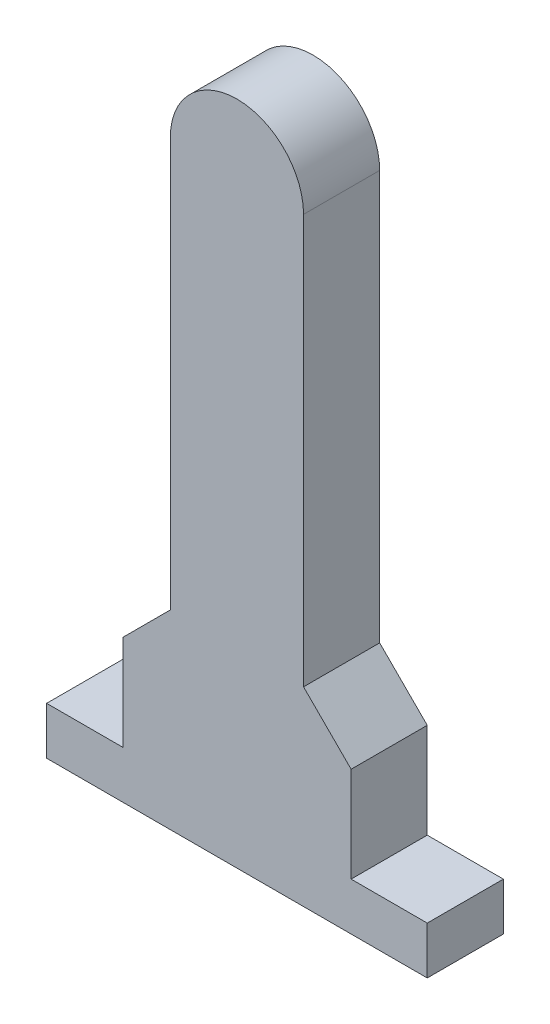
ISO-10303-21;
HEADER;
FILE_DESCRIPTION(('STEP AP214'),'2;1');
FILE_NAME('part.step','',(''),(''),'','','');
FILE_SCHEMA(('AUTOMOTIVE_DESIGN { 1 0 10303 214 1 1 1 1 }'));
ENDSEC;
DATA;
#1=APPLICATION_CONTEXT('core data for automotive mechanical design processes');
#2=APPLICATION_PROTOCOL_DEFINITION('international standard','automotive_design',2000,#1);
#3=PRODUCT_CONTEXT('',#1,'mechanical');
#4=PRODUCT('Part','Part','',(#3));
#5=PRODUCT_RELATED_PRODUCT_CATEGORY('part','',(#4));
#6=PRODUCT_DEFINITION_FORMATION('','',#4);
#7=PRODUCT_DEFINITION_CONTEXT('part definition',#1,'design');
#8=PRODUCT_DEFINITION('design','',#6,#7);
#9=PRODUCT_DEFINITION_SHAPE('','',#8);
#10=(LENGTH_UNIT() NAMED_UNIT(*) SI_UNIT(.MILLI.,.METRE.));
#11=(NAMED_UNIT(*) PLANE_ANGLE_UNIT() SI_UNIT($,.RADIAN.));
#12=(NAMED_UNIT(*) SI_UNIT($,.STERADIAN.) SOLID_ANGLE_UNIT());
#13=UNCERTAINTY_MEASURE_WITH_UNIT(LENGTH_MEASURE(1.E-05),#10,'distance_accuracy_value','');
#14=(GEOMETRIC_REPRESENTATION_CONTEXT(3) GLOBAL_UNCERTAINTY_ASSIGNED_CONTEXT((#13)) GLOBAL_UNIT_ASSIGNED_CONTEXT((#10,
#11,#12)) REPRESENTATION_CONTEXT('',''));
#15=CARTESIAN_POINT('',(0.,0.,0.));
#16=DIRECTION('',(0.,0.,1.));
#17=DIRECTION('',(1.,0.,0.));
#18=AXIS2_PLACEMENT_3D('',#15,#16,#17);
#19=CARTESIAN_POINT('',(2.,6.3,-0.4));
#20=DIRECTION('',(0.,0.,1.));
#21=DIRECTION('',(1.,0.,0.));
#22=AXIS2_PLACEMENT_3D('',#19,#20,#21);
#23=PLANE('',#22);
#24=DIRECTION('',(0.,-1.,0.));
#25=VECTOR('',#24,1.);
#26=CARTESIAN_POINT('',(0.,0.5,-0.4));
#27=LINE('',#26,#25);
#28=CARTESIAN_POINT('',(0.,0.5,-0.4));
#29=VERTEX_POINT('',#28);
#30=CARTESIAN_POINT('',(0.,0.,-0.4));
#31=VERTEX_POINT('',#30);
#32=EDGE_CURVE('E157',#29,#31,#27,.T.);
#33=ORIENTED_EDGE('',*,*,#32,.F.);
#34=DIRECTION('',(-1.,0.,0.));
#35=VECTOR('',#34,1.);
#36=CARTESIAN_POINT('',(0.8,0.5,-0.4));
#37=LINE('',#36,#35);
#38=CARTESIAN_POINT('',(0.8,0.5,-0.4));
#39=VERTEX_POINT('',#38);
#40=EDGE_CURVE('E27',#39,#29,#37,.T.);
#41=ORIENTED_EDGE('',*,*,#40,.F.);
#42=DIRECTION('',(0.,-1.,0.));
#43=VECTOR('',#42,1.);
#44=CARTESIAN_POINT('',(0.8,1.5,-0.4));
#45=LINE('',#44,#43);
#46=CARTESIAN_POINT('',(0.8,1.5,-0.4));
#47=VERTEX_POINT('',#46);
#48=EDGE_CURVE('E128',#47,#39,#45,.T.);
#49=ORIENTED_EDGE('',*,*,#48,.F.);
#50=DIRECTION('',(-0.707106781186548,-0.707106781186548,0.));
#51=VECTOR('',#50,1.);
#52=CARTESIAN_POINT('',(1.3,2.,-0.4));
#53=LINE('',#52,#51);
#54=CARTESIAN_POINT('',(1.3,2.,-0.4));
#55=VERTEX_POINT('',#54);
#56=EDGE_CURVE('E132',#55,#47,#53,.T.);
#57=ORIENTED_EDGE('',*,*,#56,.F.);
#58=DIRECTION('',(0.,-1.,0.));
#59=VECTOR('',#58,1.);
#60=CARTESIAN_POINT('',(1.3,6.3,-0.4));
#61=LINE('',#60,#59);
#62=CARTESIAN_POINT('',(1.3,6.3,-0.4));
#63=VERTEX_POINT('',#62);
#64=EDGE_CURVE('E216',#63,#55,#61,.T.);
#65=ORIENTED_EDGE('',*,*,#64,.F.);
#66=CARTESIAN_POINT('',(2.,6.3,-0.4));
#67=DIRECTION('',(0.,0.,1.));
#68=DIRECTION('',(1.,0.,0.));
#69=AXIS2_PLACEMENT_3D('',#66,#67,#68);
#70=CIRCLE('',#69,0.7);
#71=CARTESIAN_POINT('',(2.7,6.3,-0.4));
#72=VERTEX_POINT('',#71);
#73=EDGE_CURVE('E250',#72,#63,#70,.T.);
#74=ORIENTED_EDGE('',*,*,#73,.F.);
#75=DIRECTION('',(0.,1.,0.));
#76=VECTOR('',#75,1.);
#77=CARTESIAN_POINT('',(2.7,2.,-0.4));
#78=LINE('',#77,#76);
#79=CARTESIAN_POINT('',(2.7,2.,-0.4));
#80=VERTEX_POINT('',#79);
#81=EDGE_CURVE('E189',#80,#72,#78,.T.);
#82=ORIENTED_EDGE('',*,*,#81,.F.);
#83=DIRECTION('',(-0.707106781186548,0.707106781186548,0.));
#84=VECTOR('',#83,1.);
#85=CARTESIAN_POINT('',(3.2,1.5,-0.4));
#86=LINE('',#85,#84);
#87=CARTESIAN_POINT('',(3.2,1.5,-0.4));
#88=VERTEX_POINT('',#87);
#89=EDGE_CURVE('E232',#88,#80,#86,.T.);
#90=ORIENTED_EDGE('',*,*,#89,.F.);
#91=DIRECTION('',(0.,1.,0.));
#92=VECTOR('',#91,1.);
#93=CARTESIAN_POINT('',(3.2,0.5,-0.4));
#94=LINE('',#93,#92);
#95=CARTESIAN_POINT('',(3.2,0.5,-0.4));
#96=VERTEX_POINT('',#95);
#97=EDGE_CURVE('E199',#96,#88,#94,.T.);
#98=ORIENTED_EDGE('',*,*,#97,.F.);
#99=DIRECTION('',(-1.,0.,0.));
#100=VECTOR('',#99,1.);
#101=CARTESIAN_POINT('',(4.,0.5,-0.4));
#102=LINE('',#101,#100);
#103=CARTESIAN_POINT('',(4.,0.5,-0.4));
#104=VERTEX_POINT('',#103);
#105=EDGE_CURVE('E209',#104,#96,#102,.T.);
#106=ORIENTED_EDGE('',*,*,#105,.F.);
#107=DIRECTION('',(0.,1.,0.));
#108=VECTOR('',#107,1.);
#109=CARTESIAN_POINT('',(4.,0.,-0.4));
#110=LINE('',#109,#108);
#111=CARTESIAN_POINT('',(4.,0.,-0.4));
#112=VERTEX_POINT('',#111);
#113=EDGE_CURVE('E181',#112,#104,#110,.T.);
#114=ORIENTED_EDGE('',*,*,#113,.F.);
#115=DIRECTION('',(1.,0.,0.));
#116=VECTOR('',#115,1.);
#117=CARTESIAN_POINT('',(0.,0.,-0.4));
#118=LINE('',#117,#116);
#119=EDGE_CURVE('E160',#31,#112,#118,.T.);
#120=ORIENTED_EDGE('',*,*,#119,.F.);
#121=EDGE_LOOP('',(#33,#41,#49,#57,#65,#74,#82,#90,#98,#106,#114,#120));
#122=FACE_BOUND('',#121,.T.);
#123=ADVANCED_FACE('F17',(#122),#23,.F.);
#124=CARTESIAN_POINT('',(2.,6.3,0.4));
#125=DIRECTION('',(0.,0.,1.));
#126=DIRECTION('',(1.,0.,0.));
#127=AXIS2_PLACEMENT_3D('',#124,#125,#126);
#128=PLANE('',#127);
#129=DIRECTION('',(0.,-1.,0.));
#130=VECTOR('',#129,1.);
#131=CARTESIAN_POINT('',(0.,0.5,0.4));
#132=LINE('',#131,#130);
#133=CARTESIAN_POINT('',(0.,0.5,0.4));
#134=VERTEX_POINT('',#133);
#135=CARTESIAN_POINT('',(0.,0.,0.4));
#136=VERTEX_POINT('',#135);
#137=EDGE_CURVE('E158',#134,#136,#132,.T.);
#138=ORIENTED_EDGE('',*,*,#137,.T.);
#139=DIRECTION('',(1.,0.,0.));
#140=VECTOR('',#139,1.);
#141=CARTESIAN_POINT('',(0.,0.,0.4));
#142=LINE('',#141,#140);
#143=CARTESIAN_POINT('',(4.,0.,0.4));
#144=VERTEX_POINT('',#143);
#145=EDGE_CURVE('E178',#136,#144,#142,.T.);
#146=ORIENTED_EDGE('',*,*,#145,.T.);
#147=DIRECTION('',(0.,1.,0.));
#148=VECTOR('',#147,1.);
#149=CARTESIAN_POINT('',(4.,0.,0.4));
#150=LINE('',#149,#148);
#151=CARTESIAN_POINT('',(4.,0.5,0.4));
#152=VERTEX_POINT('',#151);
#153=EDGE_CURVE('E208',#144,#152,#150,.T.);
#154=ORIENTED_EDGE('',*,*,#153,.T.);
#155=DIRECTION('',(-1.,0.,0.));
#156=VECTOR('',#155,1.);
#157=CARTESIAN_POINT('',(4.,0.5,0.4));
#158=LINE('',#157,#156);
#159=CARTESIAN_POINT('',(3.2,0.5,0.4));
#160=VERTEX_POINT('',#159);
#161=EDGE_CURVE('E195',#152,#160,#158,.T.);
#162=ORIENTED_EDGE('',*,*,#161,.T.);
#163=DIRECTION('',(0.,1.,0.));
#164=VECTOR('',#163,1.);
#165=CARTESIAN_POINT('',(3.2,0.5,0.4));
#166=LINE('',#165,#164);
#167=CARTESIAN_POINT('',(3.2,1.5,0.4));
#168=VERTEX_POINT('',#167);
#169=EDGE_CURVE('E228',#160,#168,#166,.T.);
#170=ORIENTED_EDGE('',*,*,#169,.T.);
#171=DIRECTION('',(-0.707106781186548,0.707106781186548,0.));
#172=VECTOR('',#171,1.);
#173=CARTESIAN_POINT('',(3.2,1.5,0.4));
#174=LINE('',#173,#172);
#175=CARTESIAN_POINT('',(2.7,2.,0.4));
#176=VERTEX_POINT('',#175);
#177=EDGE_CURVE('E194',#168,#176,#174,.T.);
#178=ORIENTED_EDGE('',*,*,#177,.T.);
#179=DIRECTION('',(0.,1.,0.));
#180=VECTOR('',#179,1.);
#181=CARTESIAN_POINT('',(2.7,2.,0.4));
#182=LINE('',#181,#180);
#183=CARTESIAN_POINT('',(2.7,6.3,0.4));
#184=VERTEX_POINT('',#183);
#185=EDGE_CURVE('E246',#176,#184,#182,.T.);
#186=ORIENTED_EDGE('',*,*,#185,.T.);
#187=CARTESIAN_POINT('',(2.,6.3,0.4));
#188=DIRECTION('',(0.,0.,1.));
#189=DIRECTION('',(1.,0.,0.));
#190=AXIS2_PLACEMENT_3D('',#187,#188,#189);
#191=CIRCLE('',#190,0.7);
#192=CARTESIAN_POINT('',(1.3,6.3,0.4));
#193=VERTEX_POINT('',#192);
#194=EDGE_CURVE('E258',#184,#193,#191,.T.);
#195=ORIENTED_EDGE('',*,*,#194,.T.);
#196=DIRECTION('',(0.,-1.,0.));
#197=VECTOR('',#196,1.);
#198=CARTESIAN_POINT('',(1.3,6.3,0.4));
#199=LINE('',#198,#197);
#200=CARTESIAN_POINT('',(1.3,2.,0.4));
#201=VERTEX_POINT('',#200);
#202=EDGE_CURVE('E123',#193,#201,#199,.T.);
#203=ORIENTED_EDGE('',*,*,#202,.T.);
#204=DIRECTION('',(-0.707106781186548,-0.707106781186548,0.));
#205=VECTOR('',#204,1.);
#206=CARTESIAN_POINT('',(1.3,2.,0.4));
#207=LINE('',#206,#205);
#208=CARTESIAN_POINT('',(0.8,1.5,0.4));
#209=VERTEX_POINT('',#208);
#210=EDGE_CURVE('E120',#201,#209,#207,.T.);
#211=ORIENTED_EDGE('',*,*,#210,.T.);
#212=DIRECTION('',(0.,-1.,0.));
#213=VECTOR('',#212,1.);
#214=CARTESIAN_POINT('',(0.8,1.5,0.4));
#215=LINE('',#214,#213);
#216=CARTESIAN_POINT('',(0.8,0.5,0.4));
#217=VERTEX_POINT('',#216);
#218=EDGE_CURVE('E108',#209,#217,#215,.T.);
#219=ORIENTED_EDGE('',*,*,#218,.T.);
#220=DIRECTION('',(-1.,0.,0.));
#221=VECTOR('',#220,1.);
#222=CARTESIAN_POINT('',(0.8,0.5,0.4));
#223=LINE('',#222,#221);
#224=EDGE_CURVE('E11',#217,#134,#223,.T.);
#225=ORIENTED_EDGE('',*,*,#224,.T.);
#226=EDGE_LOOP('',(#138,#146,#154,#162,#170,#178,#186,#195,#203,#211,#219,#225));
#227=FACE_BOUND('',#226,.T.);
#228=ADVANCED_FACE('F19',(#227),#128,.T.);
#229=CARTESIAN_POINT('',(0.8,0.5,0.4));
#230=DIRECTION('',(0.,-1.,0.));
#231=DIRECTION('',(0.,0.,-1.));
#232=AXIS2_PLACEMENT_3D('',#229,#230,#231);
#233=PLANE('',#232);
#234=ORIENTED_EDGE('',*,*,#40,.T.);
#235=DIRECTION('',(0.,0.,-1.));
#236=VECTOR('',#235,1.);
#237=CARTESIAN_POINT('',(0.,0.5,0.4));
#238=LINE('',#237,#236);
#239=EDGE_CURVE('E146',#134,#29,#238,.T.);
#240=ORIENTED_EDGE('',*,*,#239,.F.);
#241=ORIENTED_EDGE('',*,*,#224,.F.);
#242=DIRECTION('',(0.,0.,-1.));
#243=VECTOR('',#242,1.);
#244=CARTESIAN_POINT('',(0.8,0.5,0.4));
#245=LINE('',#244,#243);
#246=EDGE_CURVE('E115',#217,#39,#245,.T.);
#247=ORIENTED_EDGE('',*,*,#246,.T.);
#248=EDGE_LOOP('',(#234,#240,#241,#247));
#249=FACE_BOUND('',#248,.T.);
#250=ADVANCED_FACE('F144',(#249),#233,.F.);
#251=CARTESIAN_POINT('',(0.8,1.5,0.4));
#252=DIRECTION('',(1.,0.,0.));
#253=DIRECTION('',(0.,1.,0.));
#254=AXIS2_PLACEMENT_3D('',#251,#252,#253);
#255=PLANE('',#254);
#256=ORIENTED_EDGE('',*,*,#48,.T.);
#257=ORIENTED_EDGE('',*,*,#246,.F.);
#258=ORIENTED_EDGE('',*,*,#218,.F.);
#259=DIRECTION('',(0.,0.,-1.));
#260=VECTOR('',#259,1.);
#261=CARTESIAN_POINT('',(0.8,1.5,0.4));
#262=LINE('',#261,#260);
#263=EDGE_CURVE('E113',#209,#47,#262,.T.);
#264=ORIENTED_EDGE('',*,*,#263,.T.);
#265=EDGE_LOOP('',(#256,#257,#258,#264));
#266=FACE_BOUND('',#265,.T.);
#267=ADVANCED_FACE('F111',(#266),#255,.F.);
#268=CARTESIAN_POINT('',(1.3,2.,0.4));
#269=DIRECTION('',(0.707106781186548,-0.707106781186548,0.));
#270=DIRECTION('',(0.,0.,-1.));
#271=AXIS2_PLACEMENT_3D('',#268,#269,#270);
#272=PLANE('',#271);
#273=ORIENTED_EDGE('',*,*,#56,.T.);
#274=ORIENTED_EDGE('',*,*,#263,.F.);
#275=ORIENTED_EDGE('',*,*,#210,.F.);
#276=DIRECTION('',(0.,0.,-1.));
#277=VECTOR('',#276,1.);
#278=CARTESIAN_POINT('',(1.3,2.,0.4));
#279=LINE('',#278,#277);
#280=EDGE_CURVE('E213',#201,#55,#279,.T.);
#281=ORIENTED_EDGE('',*,*,#280,.T.);
#282=EDGE_LOOP('',(#273,#274,#275,#281));
#283=FACE_BOUND('',#282,.T.);
#284=ADVANCED_FACE('F130',(#283),#272,.F.);
#285=CARTESIAN_POINT('',(1.3,6.3,0.4));
#286=DIRECTION('',(1.,0.,0.));
#287=DIRECTION('',(0.,-1.,0.));
#288=AXIS2_PLACEMENT_3D('',#285,#286,#287);
#289=PLANE('',#288);
#290=ORIENTED_EDGE('',*,*,#64,.T.);
#291=ORIENTED_EDGE('',*,*,#280,.F.);
#292=ORIENTED_EDGE('',*,*,#202,.F.);
#293=DIRECTION('',(0.,0.,-1.));
#294=VECTOR('',#293,1.);
#295=CARTESIAN_POINT('',(1.3,6.3,0.4));
#296=LINE('',#295,#294);
#297=EDGE_CURVE('E254',#193,#63,#296,.T.);
#298=ORIENTED_EDGE('',*,*,#297,.T.);
#299=EDGE_LOOP('',(#290,#291,#292,#298));
#300=FACE_BOUND('',#299,.T.);
#301=ADVANCED_FACE('F270',(#300),#289,.F.);
#302=CARTESIAN_POINT('',(2.,6.3,0.4));
#303=DIRECTION('',(0.,0.,-1.));
#304=DIRECTION('',(-1.,0.,0.));
#305=AXIS2_PLACEMENT_3D('',#302,#303,#304);
#306=CYLINDRICAL_SURFACE('',#305,0.7);
#307=ORIENTED_EDGE('',*,*,#73,.T.);
#308=ORIENTED_EDGE('',*,*,#297,.F.);
#309=ORIENTED_EDGE('',*,*,#194,.F.);
#310=DIRECTION('',(0.,0.,-1.));
#311=VECTOR('',#310,1.);
#312=CARTESIAN_POINT('',(2.7,6.3,0.4));
#313=LINE('',#312,#311);
#314=EDGE_CURVE('E193',#184,#72,#313,.T.);
#315=ORIENTED_EDGE('',*,*,#314,.T.);
#316=EDGE_LOOP('',(#307,#308,#309,#315));
#317=FACE_BOUND('',#316,.T.);
#318=ADVANCED_FACE('F273',(#317),#306,.T.);
#319=CARTESIAN_POINT('',(2.7,2.,0.4));
#320=DIRECTION('',(-1.,0.,0.));
#321=DIRECTION('',(0.,0.,1.));
#322=AXIS2_PLACEMENT_3D('',#319,#320,#321);
#323=PLANE('',#322);
#324=ORIENTED_EDGE('',*,*,#81,.T.);
#325=ORIENTED_EDGE('',*,*,#314,.F.);
#326=ORIENTED_EDGE('',*,*,#185,.F.);
#327=DIRECTION('',(0.,0.,-1.));
#328=VECTOR('',#327,1.);
#329=CARTESIAN_POINT('',(2.7,2.,0.4));
#330=LINE('',#329,#328);
#331=EDGE_CURVE('E236',#176,#80,#330,.T.);
#332=ORIENTED_EDGE('',*,*,#331,.T.);
#333=EDGE_LOOP('',(#324,#325,#326,#332));
#334=FACE_BOUND('',#333,.T.);
#335=ADVANCED_FACE('F278',(#334),#323,.F.);
#336=CARTESIAN_POINT('',(3.2,1.5,0.4));
#337=DIRECTION('',(-0.707106781186548,-0.707106781186548,0.));
#338=DIRECTION('',(-0.707106781186548,0.707106781186548,0.));
#339=AXIS2_PLACEMENT_3D('',#336,#337,#338);
#340=PLANE('',#339);
#341=ORIENTED_EDGE('',*,*,#89,.T.);
#342=ORIENTED_EDGE('',*,*,#331,.F.);
#343=ORIENTED_EDGE('',*,*,#177,.F.);
#344=DIRECTION('',(0.,0.,-1.));
#345=VECTOR('',#344,1.);
#346=CARTESIAN_POINT('',(3.2,1.5,0.4));
#347=LINE('',#346,#345);
#348=EDGE_CURVE('E174',#168,#88,#347,.T.);
#349=ORIENTED_EDGE('',*,*,#348,.T.);
#350=EDGE_LOOP('',(#341,#342,#343,#349));
#351=FACE_BOUND('',#350,.T.);
#352=ADVANCED_FACE('F281',(#351),#340,.F.);
#353=CARTESIAN_POINT('',(3.2,0.5,0.4));
#354=DIRECTION('',(-1.,0.,0.));
#355=DIRECTION('',(0.,0.,1.));
#356=AXIS2_PLACEMENT_3D('',#353,#354,#355);
#357=PLANE('',#356);
#358=ORIENTED_EDGE('',*,*,#97,.T.);
#359=ORIENTED_EDGE('',*,*,#348,.F.);
#360=ORIENTED_EDGE('',*,*,#169,.F.);
#361=DIRECTION('',(0.,0.,-1.));
#362=VECTOR('',#361,1.);
#363=CARTESIAN_POINT('',(3.2,0.5,0.4));
#364=LINE('',#363,#362);
#365=EDGE_CURVE('E200',#160,#96,#364,.T.);
#366=ORIENTED_EDGE('',*,*,#365,.T.);
#367=EDGE_LOOP('',(#358,#359,#360,#366));
#368=FACE_BOUND('',#367,.T.);
#369=ADVANCED_FACE('F284',(#368),#357,.F.);
#370=CARTESIAN_POINT('',(4.,0.5,0.4));
#371=DIRECTION('',(0.,-1.,0.));
#372=DIRECTION('',(-1.,0.,0.));
#373=AXIS2_PLACEMENT_3D('',#370,#371,#372);
#374=PLANE('',#373);
#375=ORIENTED_EDGE('',*,*,#105,.T.);
#376=ORIENTED_EDGE('',*,*,#365,.F.);
#377=ORIENTED_EDGE('',*,*,#161,.F.);
#378=DIRECTION('',(0.,0.,-1.));
#379=VECTOR('',#378,1.);
#380=CARTESIAN_POINT('',(4.,0.5,0.4));
#381=LINE('',#380,#379);
#382=EDGE_CURVE('E204',#152,#104,#381,.T.);
#383=ORIENTED_EDGE('',*,*,#382,.T.);
#384=EDGE_LOOP('',(#375,#376,#377,#383));
#385=FACE_BOUND('',#384,.T.);
#386=ADVANCED_FACE('F288',(#385),#374,.F.);
#387=CARTESIAN_POINT('',(4.,0.,0.4));
#388=DIRECTION('',(-1.,0.,0.));
#389=DIRECTION('',(0.,0.,1.));
#390=AXIS2_PLACEMENT_3D('',#387,#388,#389);
#391=PLANE('',#390);
#392=ORIENTED_EDGE('',*,*,#113,.T.);
#393=ORIENTED_EDGE('',*,*,#382,.F.);
#394=ORIENTED_EDGE('',*,*,#153,.F.);
#395=DIRECTION('',(0.,0.,-1.));
#396=VECTOR('',#395,1.);
#397=CARTESIAN_POINT('',(4.,0.,0.4));
#398=LINE('',#397,#396);
#399=EDGE_CURVE('E182',#144,#112,#398,.T.);
#400=ORIENTED_EDGE('',*,*,#399,.T.);
#401=EDGE_LOOP('',(#392,#393,#394,#400));
#402=FACE_BOUND('',#401,.T.);
#403=ADVANCED_FACE('F290',(#402),#391,.F.);
#404=CARTESIAN_POINT('',(0.,0.,0.4));
#405=DIRECTION('',(0.,1.,0.));
#406=DIRECTION('',(1.,0.,0.));
#407=AXIS2_PLACEMENT_3D('',#404,#405,#406);
#408=PLANE('',#407);
#409=ORIENTED_EDGE('',*,*,#119,.T.);
#410=ORIENTED_EDGE('',*,*,#399,.F.);
#411=ORIENTED_EDGE('',*,*,#145,.F.);
#412=DIRECTION('',(0.,0.,-1.));
#413=VECTOR('',#412,1.);
#414=CARTESIAN_POINT('',(0.,0.,0.4));
#415=LINE('',#414,#413);
#416=EDGE_CURVE('E167',#136,#31,#415,.T.);
#417=ORIENTED_EDGE('',*,*,#416,.T.);
#418=EDGE_LOOP('',(#409,#410,#411,#417));
#419=FACE_BOUND('',#418,.T.);
#420=ADVANCED_FACE('F295',(#419),#408,.F.);
#421=CARTESIAN_POINT('',(0.,0.5,0.4));
#422=DIRECTION('',(1.,0.,0.));
#423=DIRECTION('',(0.,-1.,0.));
#424=AXIS2_PLACEMENT_3D('',#421,#422,#423);
#425=PLANE('',#424);
#426=ORIENTED_EDGE('',*,*,#32,.T.);
#427=ORIENTED_EDGE('',*,*,#416,.F.);
#428=ORIENTED_EDGE('',*,*,#137,.F.);
#429=ORIENTED_EDGE('',*,*,#239,.T.);
#430=EDGE_LOOP('',(#426,#427,#428,#429));
#431=FACE_BOUND('',#430,.T.);
#432=ADVANCED_FACE('F155',(#431),#425,.F.);
#433=CLOSED_SHELL('',(#123,#228,#250,#267,#284,#301,#318,#335,#352,#369,#386,#403,#420,#432));
#434=MANIFOLD_SOLID_BREP('B1',#433);
#435=ADVANCED_BREP_SHAPE_REPRESENTATION('',(#18,#434),#14);
#436=SHAPE_DEFINITION_REPRESENTATION(#9,#435);
ENDSEC;
END-ISO-10303-21;
